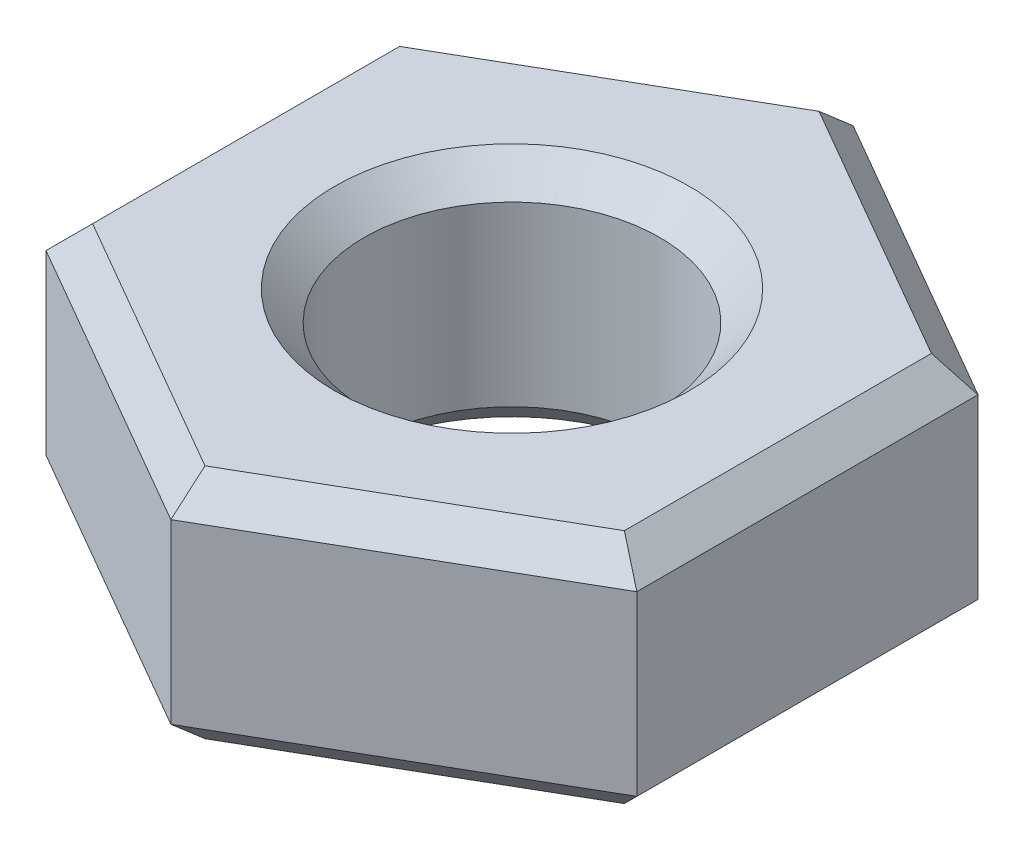
ISO-10303-21;
HEADER;
FILE_DESCRIPTION(('STEP AP214'),'2;1');
FILE_NAME('part.step','',(''),(''),'','','');
FILE_SCHEMA(('AUTOMOTIVE_DESIGN { 1 0 10303 214 1 1 1 1 }'));
ENDSEC;
DATA;
#1=APPLICATION_CONTEXT('core data for automotive mechanical design processes');
#2=APPLICATION_PROTOCOL_DEFINITION('international standard','automotive_design',2000,#1);
#3=PRODUCT_CONTEXT('',#1,'mechanical');
#4=PRODUCT('Part','Part','',(#3));
#5=PRODUCT_RELATED_PRODUCT_CATEGORY('part','',(#4));
#6=PRODUCT_DEFINITION_FORMATION('','',#4);
#7=PRODUCT_DEFINITION_CONTEXT('part definition',#1,'design');
#8=PRODUCT_DEFINITION('design','',#6,#7);
#9=PRODUCT_DEFINITION_SHAPE('','',#8);
#10=(LENGTH_UNIT() NAMED_UNIT(*) SI_UNIT(.MILLI.,.METRE.));
#11=(NAMED_UNIT(*) PLANE_ANGLE_UNIT() SI_UNIT($,.RADIAN.));
#12=(NAMED_UNIT(*) SI_UNIT($,.STERADIAN.) SOLID_ANGLE_UNIT());
#13=UNCERTAINTY_MEASURE_WITH_UNIT(LENGTH_MEASURE(1.E-05),#10,'distance_accuracy_value','');
#14=(GEOMETRIC_REPRESENTATION_CONTEXT(3) GLOBAL_UNCERTAINTY_ASSIGNED_CONTEXT((#13)) GLOBAL_UNIT_ASSIGNED_CONTEXT((#10,
#11,#12)) REPRESENTATION_CONTEXT('',''));
#15=CARTESIAN_POINT('',(0.,0.,0.));
#16=DIRECTION('',(0.,0.,1.));
#17=DIRECTION('',(1.,0.,0.));
#18=AXIS2_PLACEMENT_3D('',#15,#16,#17);
#19=CARTESIAN_POINT('',(0.,2.,0.));
#20=DIRECTION('',(0.,1.,0.));
#21=DIRECTION('',(0.,0.,1.));
#22=AXIS2_PLACEMENT_3D('',#19,#20,#21);
#23=PLANE('',#22);
#24=CARTESIAN_POINT('',(0.,2.,0.));
#25=DIRECTION('',(0.,1.,0.));
#26=DIRECTION('',(0.,0.,1.));
#27=AXIS2_PLACEMENT_3D('',#24,#25,#26);
#28=CIRCLE('',#27,1.5);
#29=CARTESIAN_POINT('',(0.,2.,1.5));
#30=VERTEX_POINT('',#29);
#31=EDGE_CURVE('E11',#30,#30,#28,.F.);
#32=ORIENTED_EDGE('',*,*,#31,.T.);
#33=EDGE_LOOP('',(#32));
#34=FACE_BOUND('',#33,.T.);
#35=DIRECTION('',(-0.866025403784435,0.,0.500000000000007));
#36=VECTOR('',#35,1.);
#37=CARTESIAN_POINT('',(-2.37500000000001,2.,-1.22686932202793));
#38=LINE('',#37,#36);
#39=CARTESIAN_POINT('',(0.,2.,-2.59807621135331));
#40=VERTEX_POINT('',#39);
#41=CARTESIAN_POINT('',(-2.25000000000001,2.,-1.29903810567664));
#42=VERTEX_POINT('',#41);
#43=EDGE_CURVE('E60',#40,#42,#38,.T.);
#44=ORIENTED_EDGE('',*,*,#43,.T.);
#45=DIRECTION('',(0.,0.,1.));
#46=VECTOR('',#45,1.);
#47=CARTESIAN_POINT('',(-2.24999999999998,2.,1.44337567297409));
#48=LINE('',#47,#46);
#49=CARTESIAN_POINT('',(-2.24999999999998,2.,1.29903810567668));
#50=VERTEX_POINT('',#49);
#51=EDGE_CURVE('E52',#42,#50,#48,.T.);
#52=ORIENTED_EDGE('',*,*,#51,.T.);
#53=DIRECTION('',(0.866025403784442,0.,0.499999999999995));
#54=VECTOR('',#53,1.);
#55=CARTESIAN_POINT('',(0.125,2.,2.67024499500202));
#56=LINE('',#55,#54);
#57=CARTESIAN_POINT('',(0.,2.,2.59807621135332));
#58=VERTEX_POINT('',#57);
#59=EDGE_CURVE('E218',#50,#58,#56,.T.);
#60=ORIENTED_EDGE('',*,*,#59,.T.);
#61=DIRECTION('',(0.866025403784438,0.,-0.500000000000001));
#62=VECTOR('',#61,1.);
#63=CARTESIAN_POINT('',(2.375,2.,1.22686932202795));
#64=LINE('',#63,#62);
#65=CARTESIAN_POINT('',(2.25,2.,1.29903810567665));
#66=VERTEX_POINT('',#65);
#67=EDGE_CURVE('E221',#58,#66,#64,.T.);
#68=ORIENTED_EDGE('',*,*,#67,.T.);
#69=DIRECTION('',(0.,0.,-1.));
#70=VECTOR('',#69,1.);
#71=CARTESIAN_POINT('',(2.24999999999999,2.,-1.44337567297408));
#72=LINE('',#71,#70);
#73=CARTESIAN_POINT('',(2.24999999999999,2.,-1.29903810567667));
#74=VERTEX_POINT('',#73);
#75=EDGE_CURVE('E224',#66,#74,#72,.T.);
#76=ORIENTED_EDGE('',*,*,#75,.T.);
#77=DIRECTION('',(-0.866025403784442,0.,-0.499999999999995));
#78=VECTOR('',#77,1.);
#79=CARTESIAN_POINT('',(-0.12500000000002,2.,-2.67024499500202));
#80=LINE('',#79,#78);
#81=EDGE_CURVE('E65',#74,#40,#80,.T.);
#82=ORIENTED_EDGE('',*,*,#81,.T.);
#83=EDGE_LOOP('',(#44,#52,#60,#68,#76,#82));
#84=FACE_BOUND('',#83,.T.);
#85=ADVANCED_FACE('F41',(#34,#84),#23,.T.);
#86=CARTESIAN_POINT('',(0.,0.,0.));
#87=DIRECTION('',(0.,1.,0.));
#88=DIRECTION('',(0.,0.,1.));
#89=AXIS2_PLACEMENT_3D('',#86,#87,#88);
#90=PLANE('',#89);
#91=CARTESIAN_POINT('',(0.,0.,0.));
#92=DIRECTION('',(0.,1.,0.));
#93=DIRECTION('',(0.,0.,1.));
#94=AXIS2_PLACEMENT_3D('',#91,#92,#93);
#95=CIRCLE('',#94,1.5);
#96=CARTESIAN_POINT('',(0.,0.,1.5));
#97=VERTEX_POINT('',#96);
#98=EDGE_CURVE('E164',#97,#97,#95,.T.);
#99=ORIENTED_EDGE('',*,*,#98,.T.);
#100=EDGE_LOOP('',(#99));
#101=FACE_BOUND('',#100,.T.);
#102=DIRECTION('',(0.,0.,1.));
#103=VECTOR('',#102,1.);
#104=CARTESIAN_POINT('',(2.25,0.,0.));
#105=LINE('',#104,#103);
#106=CARTESIAN_POINT('',(2.25,0.,-1.29903810567667));
#107=VERTEX_POINT('',#106);
#108=CARTESIAN_POINT('',(2.25,0.,1.29903810567665));
#109=VERTEX_POINT('',#108);
#110=EDGE_CURVE('E162',#107,#109,#105,.T.);
#111=ORIENTED_EDGE('',*,*,#110,.T.);
#112=DIRECTION('',(-0.866025403784438,0.,0.500000000000001));
#113=VECTOR('',#112,1.);
#114=CARTESIAN_POINT('',(1.125,0.,1.94855715851499));
#115=LINE('',#114,#113);
#116=CARTESIAN_POINT('',(0.,0.,2.59807621135332));
#117=VERTEX_POINT('',#116);
#118=EDGE_CURVE('E139',#109,#117,#115,.T.);
#119=ORIENTED_EDGE('',*,*,#118,.T.);
#120=DIRECTION('',(-0.866025403784442,0.,-0.499999999999995));
#121=VECTOR('',#120,1.);
#122=CARTESIAN_POINT('',(-1.12499999999999,0.,1.948557158515));
#123=LINE('',#122,#121);
#124=CARTESIAN_POINT('',(-2.24999999999999,0.,1.29903810567669));
#125=VERTEX_POINT('',#124);
#126=EDGE_CURVE('E150',#117,#125,#123,.T.);
#127=ORIENTED_EDGE('',*,*,#126,.T.);
#128=DIRECTION('',(0.,0.,-1.));
#129=VECTOR('',#128,1.);
#130=CARTESIAN_POINT('',(-2.25,0.,0.));
#131=LINE('',#130,#129);
#132=CARTESIAN_POINT('',(-2.25000000000001,0.,-1.29903810567664));
#133=VERTEX_POINT('',#132);
#134=EDGE_CURVE('E157',#125,#133,#131,.T.);
#135=ORIENTED_EDGE('',*,*,#134,.T.);
#136=DIRECTION('',(0.866025403784435,0.,-0.500000000000007));
#137=VECTOR('',#136,1.);
#138=CARTESIAN_POINT('',(-1.12500000000002,0.,-1.94855715851498));
#139=LINE('',#138,#137);
#140=CARTESIAN_POINT('',(0.,0.,-2.59807621135332));
#141=VERTEX_POINT('',#140);
#142=EDGE_CURVE('E301',#133,#141,#139,.T.);
#143=ORIENTED_EDGE('',*,*,#142,.T.);
#144=DIRECTION('',(0.866025403784442,0.,0.499999999999995));
#145=VECTOR('',#144,1.);
#146=CARTESIAN_POINT('',(1.12499999999999,0.,-1.94855715851499));
#147=LINE('',#146,#145);
#148=EDGE_CURVE('E171',#141,#107,#147,.T.);
#149=ORIENTED_EDGE('',*,*,#148,.T.);
#150=EDGE_LOOP('',(#111,#119,#127,#135,#143,#149));
#151=FACE_BOUND('',#150,.T.);
#152=ADVANCED_FACE('F160',(#101,#151),#90,.F.);
#153=CARTESIAN_POINT('',(-2.49999999999998,2.,1.44337567297409));
#154=DIRECTION('',(0.499999999999995,0.,-0.866025403784441));
#155=DIRECTION('',(-0.866025403784442,0.,-0.499999999999995));
#156=AXIS2_PLACEMENT_3D('',#153,#154,#155);
#157=PLANE('',#156);
#158=DIRECTION('',(0.,-1.,0.));
#159=VECTOR('',#158,1.);
#160=CARTESIAN_POINT('',(-2.49999999999998,2.,1.44337567297409));
#161=LINE('',#160,#159);
#162=CARTESIAN_POINT('',(-2.49999999999998,1.75,1.44337567297409));
#163=VERTEX_POINT('',#162);
#164=CARTESIAN_POINT('',(-2.49999999999998,0.249999999999999,1.44337567297409));
#165=VERTEX_POINT('',#164);
#166=EDGE_CURVE('E248',#163,#165,#161,.T.);
#167=ORIENTED_EDGE('',*,*,#166,.T.);
#168=DIRECTION('',(0.866025403784442,0.,0.499999999999995));
#169=VECTOR('',#168,1.);
#170=CARTESIAN_POINT('',(-2.49999999999998,0.249999999999999,1.44337567297409));
#171=LINE('',#170,#169);
#172=CARTESIAN_POINT('',(0.,0.249999999999999,2.88675134594813));
#173=VERTEX_POINT('',#172);
#174=EDGE_CURVE('E215',#165,#173,#171,.T.);
#175=ORIENTED_EDGE('',*,*,#174,.T.);
#176=DIRECTION('',(0.,-1.,0.));
#177=VECTOR('',#176,1.);
#178=CARTESIAN_POINT('',(0.,2.,2.88675134594813));
#179=LINE('',#178,#177);
#180=CARTESIAN_POINT('',(0.,1.75,2.88675134594813));
#181=VERTEX_POINT('',#180);
#182=EDGE_CURVE('E158',#181,#173,#179,.T.);
#183=ORIENTED_EDGE('',*,*,#182,.F.);
#184=DIRECTION('',(-0.866025403784442,0.,-0.499999999999995));
#185=VECTOR('',#184,1.);
#186=CARTESIAN_POINT('',(-2.49999999999998,1.75,1.44337567297409));
#187=LINE('',#186,#185);
#188=EDGE_CURVE('E212',#181,#163,#187,.T.);
#189=ORIENTED_EDGE('',*,*,#188,.T.);
#190=EDGE_LOOP('',(#167,#175,#183,#189));
#191=FACE_BOUND('',#190,.T.);
#192=ADVANCED_FACE('F330',(#191),#157,.F.);
#193=CARTESIAN_POINT('',(0.,2.,2.88675134594813));
#194=DIRECTION('',(-0.500000000000001,0.,-0.866025403784438));
#195=DIRECTION('',(-0.866025403784438,0.,0.500000000000001));
#196=AXIS2_PLACEMENT_3D('',#193,#194,#195);
#197=PLANE('',#196);
#198=ORIENTED_EDGE('',*,*,#182,.T.);
#199=DIRECTION('',(0.866025403784438,0.,-0.500000000000001));
#200=VECTOR('',#199,1.);
#201=CARTESIAN_POINT('',(0.,0.249999999999999,2.88675134594813));
#202=LINE('',#201,#200);
#203=CARTESIAN_POINT('',(2.50000000000001,0.249999999999999,1.44337567297406));
#204=VERTEX_POINT('',#203);
#205=EDGE_CURVE('E142',#173,#204,#202,.T.);
#206=ORIENTED_EDGE('',*,*,#205,.T.);
#207=DIRECTION('',(0.,-1.,0.));
#208=VECTOR('',#207,1.);
#209=CARTESIAN_POINT('',(2.50000000000001,2.,1.44337567297406));
#210=LINE('',#209,#208);
#211=CARTESIAN_POINT('',(2.50000000000001,1.75,1.44337567297406));
#212=VERTEX_POINT('',#211);
#213=EDGE_CURVE('E283',#212,#204,#210,.T.);
#214=ORIENTED_EDGE('',*,*,#213,.F.);
#215=DIRECTION('',(-0.866025403784438,0.,0.500000000000001));
#216=VECTOR('',#215,1.);
#217=CARTESIAN_POINT('',(0.,1.75,2.88675134594813));
#218=LINE('',#217,#216);
#219=EDGE_CURVE('E182',#212,#181,#218,.T.);
#220=ORIENTED_EDGE('',*,*,#219,.T.);
#221=EDGE_LOOP('',(#198,#206,#214,#220));
#222=FACE_BOUND('',#221,.T.);
#223=ADVANCED_FACE('F288',(#222),#197,.F.);
#224=CARTESIAN_POINT('',(2.50000000000001,2.,1.44337567297406));
#225=DIRECTION('',(-1.,0.,0.));
#226=DIRECTION('',(0.,0.,1.));
#227=AXIS2_PLACEMENT_3D('',#224,#225,#226);
#228=PLANE('',#227);
#229=ORIENTED_EDGE('',*,*,#213,.T.);
#230=DIRECTION('',(0.,0.,-1.));
#231=VECTOR('',#230,1.);
#232=CARTESIAN_POINT('',(2.50000000000001,0.249999999999999,1.44337567297406));
#233=LINE('',#232,#231);
#234=CARTESIAN_POINT('',(2.5,0.249999999999999,-1.44337567297408));
#235=VERTEX_POINT('',#234);
#236=EDGE_CURVE('E190',#204,#235,#233,.T.);
#237=ORIENTED_EDGE('',*,*,#236,.T.);
#238=DIRECTION('',(0.,-1.,0.));
#239=VECTOR('',#238,1.);
#240=CARTESIAN_POINT('',(2.5,2.,-1.44337567297408));
#241=LINE('',#240,#239);
#242=CARTESIAN_POINT('',(2.5,1.75,-1.44337567297408));
#243=VERTEX_POINT('',#242);
#244=EDGE_CURVE('E285',#243,#235,#241,.T.);
#245=ORIENTED_EDGE('',*,*,#244,.F.);
#246=DIRECTION('',(0.,0.,1.));
#247=VECTOR('',#246,1.);
#248=CARTESIAN_POINT('',(2.50000000000001,1.75,1.44337567297406));
#249=LINE('',#248,#247);
#250=EDGE_CURVE('E187',#243,#212,#249,.T.);
#251=ORIENTED_EDGE('',*,*,#250,.T.);
#252=EDGE_LOOP('',(#229,#237,#245,#251));
#253=FACE_BOUND('',#252,.T.);
#254=ADVANCED_FACE('F282',(#253),#228,.F.);
#255=CARTESIAN_POINT('',(2.5,2.,-1.44337567297408));
#256=DIRECTION('',(-0.499999999999995,0.,0.866025403784442));
#257=DIRECTION('',(0.866025403784442,0.,0.499999999999995));
#258=AXIS2_PLACEMENT_3D('',#255,#256,#257);
#259=PLANE('',#258);
#260=ORIENTED_EDGE('',*,*,#244,.T.);
#261=DIRECTION('',(-0.866025403784442,0.,-0.499999999999995));
#262=VECTOR('',#261,1.);
#263=CARTESIAN_POINT('',(2.5,0.249999999999999,-1.44337567297408));
#264=LINE('',#263,#262);
#265=CARTESIAN_POINT('',(0.,0.249999999999999,-2.88675134594813));
#266=VERTEX_POINT('',#265);
#267=EDGE_CURVE('E196',#235,#266,#264,.T.);
#268=ORIENTED_EDGE('',*,*,#267,.T.);
#269=DIRECTION('',(0.,-1.,0.));
#270=VECTOR('',#269,1.);
#271=CARTESIAN_POINT('',(0.,2.,-2.88675134594813));
#272=LINE('',#271,#270);
#273=CARTESIAN_POINT('',(0.,1.75,-2.88675134594813));
#274=VERTEX_POINT('',#273);
#275=EDGE_CURVE('E295',#274,#266,#272,.T.);
#276=ORIENTED_EDGE('',*,*,#275,.F.);
#277=DIRECTION('',(0.866025403784442,0.,0.499999999999995));
#278=VECTOR('',#277,1.);
#279=CARTESIAN_POINT('',(2.5,1.75,-1.44337567297408));
#280=LINE('',#279,#278);
#281=EDGE_CURVE('E193',#274,#243,#280,.T.);
#282=ORIENTED_EDGE('',*,*,#281,.T.);
#283=EDGE_LOOP('',(#260,#268,#276,#282));
#284=FACE_BOUND('',#283,.T.);
#285=ADVANCED_FACE('F315',(#284),#259,.F.);
#286=CARTESIAN_POINT('',(0.,2.,-2.88675134594813));
#287=DIRECTION('',(0.500000000000007,0.,0.866025403784435));
#288=DIRECTION('',(0.866025403784435,0.,-0.500000000000007));
#289=AXIS2_PLACEMENT_3D('',#286,#287,#288);
#290=PLANE('',#289);
#291=ORIENTED_EDGE('',*,*,#275,.T.);
#292=DIRECTION('',(-0.866025403784435,0.,0.500000000000007));
#293=VECTOR('',#292,1.);
#294=CARTESIAN_POINT('',(0.,0.249999999999999,-2.88675134594813));
#295=LINE('',#294,#293);
#296=CARTESIAN_POINT('',(-2.50000000000002,0.249999999999999,-1.44337567297404));
#297=VERTEX_POINT('',#296);
#298=EDGE_CURVE('E202',#266,#297,#295,.T.);
#299=ORIENTED_EDGE('',*,*,#298,.T.);
#300=DIRECTION('',(0.,-1.,0.));
#301=VECTOR('',#300,1.);
#302=CARTESIAN_POINT('',(-2.50000000000002,2.,-1.44337567297404));
#303=LINE('',#302,#301);
#304=CARTESIAN_POINT('',(-2.50000000000002,1.75,-1.44337567297404));
#305=VERTEX_POINT('',#304);
#306=EDGE_CURVE('E321',#305,#297,#303,.T.);
#307=ORIENTED_EDGE('',*,*,#306,.F.);
#308=DIRECTION('',(0.866025403784435,0.,-0.500000000000007));
#309=VECTOR('',#308,1.);
#310=CARTESIAN_POINT('',(0.,1.75,-2.88675134594813));
#311=LINE('',#310,#309);
#312=EDGE_CURVE('E199',#305,#274,#311,.T.);
#313=ORIENTED_EDGE('',*,*,#312,.T.);
#314=EDGE_LOOP('',(#291,#299,#307,#313));
#315=FACE_BOUND('',#314,.T.);
#316=ADVANCED_FACE('F341',(#315),#290,.F.);
#317=CARTESIAN_POINT('',(-2.50000000000002,2.,-1.44337567297404));
#318=DIRECTION('',(1.,0.,0.));
#319=DIRECTION('',(0.,0.,-1.));
#320=AXIS2_PLACEMENT_3D('',#317,#318,#319);
#321=PLANE('',#320);
#322=ORIENTED_EDGE('',*,*,#306,.T.);
#323=DIRECTION('',(0.,0.,1.));
#324=VECTOR('',#323,1.);
#325=CARTESIAN_POINT('',(-2.50000000000002,0.249999999999999,-1.44337567297404));
#326=LINE('',#325,#324);
#327=EDGE_CURVE('E209',#297,#165,#326,.T.);
#328=ORIENTED_EDGE('',*,*,#327,.T.);
#329=ORIENTED_EDGE('',*,*,#166,.F.);
#330=DIRECTION('',(0.,0.,-1.));
#331=VECTOR('',#330,1.);
#332=CARTESIAN_POINT('',(-2.50000000000002,1.75,-1.44337567297404));
#333=LINE('',#332,#331);
#334=EDGE_CURVE('E205',#163,#305,#333,.T.);
#335=ORIENTED_EDGE('',*,*,#334,.T.);
#336=EDGE_LOOP('',(#322,#328,#329,#335));
#337=FACE_BOUND('',#336,.T.);
#338=ADVANCED_FACE('F342',(#337),#321,.F.);
#339=CARTESIAN_POINT('',(0.,2.,0.));
#340=DIRECTION('',(0.,-1.,0.));
#341=DIRECTION('',(0.,0.,-1.));
#342=AXIS2_PLACEMENT_3D('',#339,#340,#341);
#343=CYLINDRICAL_SURFACE('',#342,1.25);
#344=CARTESIAN_POINT('',(0.,0.25,0.));
#345=DIRECTION('',(0.,1.,0.));
#346=DIRECTION('',(0.,0.,1.));
#347=AXIS2_PLACEMENT_3D('',#344,#345,#346);
#348=CIRCLE('',#347,1.25);
#349=CARTESIAN_POINT('',(0.,0.25,1.25));
#350=VERTEX_POINT('',#349);
#351=EDGE_CURVE('E178',#350,#350,#348,.F.);
#352=ORIENTED_EDGE('',*,*,#351,.T.);
#353=EDGE_LOOP('',(#352));
#354=FACE_BOUND('',#353,.T.);
#355=CARTESIAN_POINT('',(0.,1.75,0.));
#356=DIRECTION('',(0.,1.,0.));
#357=DIRECTION('',(0.,0.,1.));
#358=AXIS2_PLACEMENT_3D('',#355,#356,#357);
#359=CIRCLE('',#358,1.25);
#360=CARTESIAN_POINT('',(0.,1.75,1.25));
#361=VERTEX_POINT('',#360);
#362=EDGE_CURVE('E169',#361,#361,#359,.T.);
#363=ORIENTED_EDGE('',*,*,#362,.T.);
#364=EDGE_LOOP('',(#363));
#365=FACE_BOUND('',#364,.T.);
#366=ADVANCED_FACE('F361',(#354,#365),#343,.F.);
#367=CARTESIAN_POINT('',(0.,0.,0.));
#368=DIRECTION('',(0.,-1.,0.));
#369=DIRECTION('',(0.,0.,-1.));
#370=AXIS2_PLACEMENT_3D('',#367,#368,#369);
#371=CONICAL_SURFACE('',#370,1.5,0.785398163397448);
#372=ORIENTED_EDGE('',*,*,#351,.F.);
#373=EDGE_LOOP('',(#372));
#374=FACE_BOUND('',#373,.T.);
#375=ORIENTED_EDGE('',*,*,#98,.F.);
#376=EDGE_LOOP('',(#375));
#377=FACE_BOUND('',#376,.T.);
#378=ADVANCED_FACE('F376',(#374,#377),#371,.F.);
#379=CARTESIAN_POINT('',(0.,0.249999999999999,-2.88675134594813));
#380=DIRECTION('',(0.353553390593277,0.70710678118655,0.61237243569579));
#381=DIRECTION('',(-0.866025403784435,0.,0.500000000000007));
#382=AXIS2_PLACEMENT_3D('',#379,#380,#381);
#383=PLANE('',#382);
#384=DIRECTION('',(0.,-0.654653670707975,0.755928946018456));
#385=VECTOR('',#384,1.);
#386=CARTESIAN_POINT('',(0.,0.249999999999999,-2.88675134594813));
#387=LINE('',#386,#385);
#388=EDGE_CURVE('E240',#141,#266,#387,.F.);
#389=ORIENTED_EDGE('',*,*,#388,.F.);
#390=ORIENTED_EDGE('',*,*,#142,.F.);
#391=DIRECTION('',(0.654653670707982,-0.654653670707975,0.377964473009223));
#392=VECTOR('',#391,1.);
#393=CARTESIAN_POINT('',(-2.50000000000002,0.249999999999999,-1.44337567297404));
#394=LINE('',#393,#392);
#395=EDGE_CURVE('E244',#297,#133,#394,.T.);
#396=ORIENTED_EDGE('',*,*,#395,.F.);
#397=ORIENTED_EDGE('',*,*,#298,.F.);
#398=EDGE_LOOP('',(#389,#390,#396,#397));
#399=FACE_BOUND('',#398,.T.);
#400=ADVANCED_FACE('F339',(#399),#383,.F.);
#401=CARTESIAN_POINT('',(-2.50000000000002,0.249999999999999,-1.44337567297404));
#402=DIRECTION('',(0.707106781186546,0.707106781186549,0.));
#403=DIRECTION('',(0.,0.,1.));
#404=AXIS2_PLACEMENT_3D('',#401,#402,#403);
#405=PLANE('',#404);
#406=ORIENTED_EDGE('',*,*,#395,.T.);
#407=ORIENTED_EDGE('',*,*,#134,.F.);
#408=DIRECTION('',(0.654653670707975,-0.654653670707975,-0.377964473009234));
#409=VECTOR('',#408,1.);
#410=CARTESIAN_POINT('',(-2.49999999999998,0.249999999999999,1.44337567297409));
#411=LINE('',#410,#409);
#412=EDGE_CURVE('E153',#165,#125,#411,.T.);
#413=ORIENTED_EDGE('',*,*,#412,.F.);
#414=ORIENTED_EDGE('',*,*,#327,.F.);
#415=EDGE_LOOP('',(#406,#407,#413,#414));
#416=FACE_BOUND('',#415,.T.);
#417=ADVANCED_FACE('F336',(#416),#405,.F.);
#418=CARTESIAN_POINT('',(2.5,0.249999999999999,-1.44337567297408));
#419=DIRECTION('',(-0.35355339059327,0.707106781186549,0.612372435695796));
#420=DIRECTION('',(-0.866025403784442,0.,-0.499999999999995));
#421=AXIS2_PLACEMENT_3D('',#418,#419,#420);
#422=PLANE('',#421);
#423=ORIENTED_EDGE('',*,*,#388,.T.);
#424=ORIENTED_EDGE('',*,*,#267,.F.);
#425=DIRECTION('',(-0.654653670707977,-0.654653670707975,0.37796447300923));
#426=VECTOR('',#425,1.);
#427=CARTESIAN_POINT('',(2.5,0.249999999999999,-1.44337567297408));
#428=LINE('',#427,#426);
#429=EDGE_CURVE('E146',#107,#235,#428,.F.);
#430=ORIENTED_EDGE('',*,*,#429,.F.);
#431=ORIENTED_EDGE('',*,*,#148,.F.);
#432=EDGE_LOOP('',(#423,#424,#430,#431));
#433=FACE_BOUND('',#432,.T.);
#434=ADVANCED_FACE('F310',(#433),#422,.F.);
#435=CARTESIAN_POINT('',(-2.49999999999998,0.249999999999999,1.44337567297409));
#436=DIRECTION('',(0.353553390593269,0.70710678118655,-0.612372435695795));
#437=DIRECTION('',(0.866025403784442,0.,0.499999999999995));
#438=AXIS2_PLACEMENT_3D('',#435,#436,#437);
#439=PLANE('',#438);
#440=ORIENTED_EDGE('',*,*,#412,.T.);
#441=ORIENTED_EDGE('',*,*,#126,.F.);
#442=DIRECTION('',(0.,0.654653670707976,0.755928946018456));
#443=VECTOR('',#442,1.);
#444=CARTESIAN_POINT('',(0.,-0.464285714285701,2.06196524710582));
#445=LINE('',#444,#443);
#446=EDGE_CURVE('E135',#173,#117,#445,.F.);
#447=ORIENTED_EDGE('',*,*,#446,.F.);
#448=ORIENTED_EDGE('',*,*,#174,.F.);
#449=EDGE_LOOP('',(#440,#441,#447,#448));
#450=FACE_BOUND('',#449,.T.);
#451=ADVANCED_FACE('F151',(#450),#439,.F.);
#452=CARTESIAN_POINT('',(2.50000000000001,0.249999999999999,1.44337567297406));
#453=DIRECTION('',(-0.707106781186546,0.707106781186549,0.));
#454=DIRECTION('',(0.,0.,-1.));
#455=AXIS2_PLACEMENT_3D('',#452,#453,#454);
#456=PLANE('',#455);
#457=ORIENTED_EDGE('',*,*,#429,.T.);
#458=ORIENTED_EDGE('',*,*,#236,.F.);
#459=DIRECTION('',(-0.65465367070798,-0.654653670707976,-0.377964473009225));
#460=VECTOR('',#459,1.);
#461=CARTESIAN_POINT('',(2.50000000000001,0.249999999999999,1.44337567297406));
#462=LINE('',#461,#460);
#463=EDGE_CURVE('E147',#109,#204,#462,.F.);
#464=ORIENTED_EDGE('',*,*,#463,.F.);
#465=ORIENTED_EDGE('',*,*,#110,.F.);
#466=EDGE_LOOP('',(#457,#458,#464,#465));
#467=FACE_BOUND('',#466,.T.);
#468=ADVANCED_FACE('F313',(#467),#456,.F.);
#469=CARTESIAN_POINT('',(0.,0.249999999999999,2.88675134594813));
#470=DIRECTION('',(-0.353553390593274,0.707106781186548,-0.612372435695793));
#471=DIRECTION('',(0.866025403784438,0.,-0.500000000000001));
#472=AXIS2_PLACEMENT_3D('',#469,#470,#471);
#473=PLANE('',#472);
#474=ORIENTED_EDGE('',*,*,#446,.T.);
#475=ORIENTED_EDGE('',*,*,#118,.F.);
#476=ORIENTED_EDGE('',*,*,#463,.T.);
#477=ORIENTED_EDGE('',*,*,#205,.F.);
#478=EDGE_LOOP('',(#474,#475,#476,#477));
#479=FACE_BOUND('',#478,.T.);
#480=ADVANCED_FACE('F137',(#479),#473,.F.);
#481=CARTESIAN_POINT('',(0.,1.75,0.));
#482=DIRECTION('',(0.,1.,0.));
#483=DIRECTION('',(0.,0.,1.));
#484=AXIS2_PLACEMENT_3D('',#481,#482,#483);
#485=CONICAL_SURFACE('',#484,1.25,0.785398163397452);
#486=ORIENTED_EDGE('',*,*,#31,.F.);
#487=EDGE_LOOP('',(#486));
#488=FACE_BOUND('',#487,.T.);
#489=ORIENTED_EDGE('',*,*,#362,.F.);
#490=EDGE_LOOP('',(#489));
#491=FACE_BOUND('',#490,.T.);
#492=ADVANCED_FACE('F390',(#488,#491),#485,.F.);
#493=CARTESIAN_POINT('',(2.25,2.,0.));
#494=DIRECTION('',(0.70710678118655,0.707106781186545,0.));
#495=DIRECTION('',(0.,0.,1.));
#496=AXIS2_PLACEMENT_3D('',#493,#494,#495);
#497=PLANE('',#496);
#498=DIRECTION('',(-0.654653670707976,0.654653670707979,-0.377964473009225));
#499=VECTOR('',#498,1.);
#500=CARTESIAN_POINT('',(1.92857142857143,2.32142857142857,1.11346123343713));
#501=LINE('',#500,#499);
#502=EDGE_CURVE('E262',#212,#66,#501,.T.);
#503=ORIENTED_EDGE('',*,*,#502,.F.);
#504=ORIENTED_EDGE('',*,*,#250,.F.);
#505=DIRECTION('',(-0.654653670707974,0.654653670707979,0.37796447300923));
#506=VECTOR('',#505,1.);
#507=CARTESIAN_POINT('',(1.92857142857142,2.32142857142857,-1.11346123343714));
#508=LINE('',#507,#506);
#509=EDGE_CURVE('E46',#74,#243,#508,.F.);
#510=ORIENTED_EDGE('',*,*,#509,.F.);
#511=ORIENTED_EDGE('',*,*,#75,.F.);
#512=EDGE_LOOP('',(#503,#504,#510,#511));
#513=FACE_BOUND('',#512,.T.);
#514=ADVANCED_FACE('F44',(#513),#497,.T.);
#515=CARTESIAN_POINT('',(1.12499999999999,2.,-1.94855715851499));
#516=DIRECTION('',(0.353553390593271,0.707106781186546,-0.612372435695798));
#517=DIRECTION('',(0.866025403784442,0.,0.499999999999995));
#518=AXIS2_PLACEMENT_3D('',#515,#516,#517);
#519=PLANE('',#518);
#520=ORIENTED_EDGE('',*,*,#509,.T.);
#521=ORIENTED_EDGE('',*,*,#281,.F.);
#522=DIRECTION('',(0.,0.654653670707979,0.755928946018453));
#523=VECTOR('',#522,1.);
#524=CARTESIAN_POINT('',(0.,2.32142857142857,-2.22692246687427));
#525=LINE('',#524,#523);
#526=EDGE_CURVE('E259',#40,#274,#525,.F.);
#527=ORIENTED_EDGE('',*,*,#526,.F.);
#528=ORIENTED_EDGE('',*,*,#81,.F.);
#529=EDGE_LOOP('',(#520,#521,#527,#528));
#530=FACE_BOUND('',#529,.T.);
#531=ADVANCED_FACE('F274',(#530),#519,.T.);
#532=CARTESIAN_POINT('',(1.125,2.,1.94855715851498));
#533=DIRECTION('',(0.353553390593275,0.707106781186545,0.612372435695796));
#534=DIRECTION('',(-0.866025403784438,0.,0.500000000000001));
#535=AXIS2_PLACEMENT_3D('',#532,#533,#534);
#536=PLANE('',#535);
#537=ORIENTED_EDGE('',*,*,#502,.T.);
#538=ORIENTED_EDGE('',*,*,#67,.F.);
#539=DIRECTION('',(0.,0.654653670707979,-0.755928946018453));
#540=VECTOR('',#539,1.);
#541=CARTESIAN_POINT('',(0.,2.32142857142857,2.22692246687428));
#542=LINE('',#541,#540);
#543=EDGE_CURVE('E255',#181,#58,#542,.T.);
#544=ORIENTED_EDGE('',*,*,#543,.F.);
#545=ORIENTED_EDGE('',*,*,#219,.F.);
#546=EDGE_LOOP('',(#537,#538,#544,#545));
#547=FACE_BOUND('',#546,.T.);
#548=ADVANCED_FACE('F436',(#547),#536,.T.);
#549=CARTESIAN_POINT('',(-1.12500000000001,2.,-1.94855715851498));
#550=DIRECTION('',(-0.353553390593279,0.707106781186546,-0.612372435695793));
#551=DIRECTION('',(0.866025403784435,0.,-0.500000000000007));
#552=AXIS2_PLACEMENT_3D('',#549,#550,#551);
#553=PLANE('',#552);
#554=ORIENTED_EDGE('',*,*,#526,.T.);
#555=ORIENTED_EDGE('',*,*,#312,.F.);
#556=DIRECTION('',(0.654653670707979,0.654653670707978,0.377964473009222));
#557=VECTOR('',#556,1.);
#558=CARTESIAN_POINT('',(-1.92857142857144,2.32142857142857,-1.11346123343712));
#559=LINE('',#558,#557);
#560=EDGE_CURVE('E252',#42,#305,#559,.F.);
#561=ORIENTED_EDGE('',*,*,#560,.F.);
#562=ORIENTED_EDGE('',*,*,#43,.F.);
#563=EDGE_LOOP('',(#554,#555,#561,#562));
#564=FACE_BOUND('',#563,.T.);
#565=ADVANCED_FACE('F430',(#564),#553,.T.);
#566=CARTESIAN_POINT('',(-1.12499999999999,2.,1.948557158515));
#567=DIRECTION('',(-0.353553390593271,0.707106781186546,0.612372435695797));
#568=DIRECTION('',(-0.866025403784442,0.,-0.499999999999995));
#569=AXIS2_PLACEMENT_3D('',#566,#567,#568);
#570=PLANE('',#569);
#571=ORIENTED_EDGE('',*,*,#543,.T.);
#572=ORIENTED_EDGE('',*,*,#59,.F.);
#573=DIRECTION('',(-0.654653670707972,-0.654653670707979,0.377964473009233));
#574=VECTOR('',#573,1.);
#575=CARTESIAN_POINT('',(-1.92857142857142,2.32142857142857,1.11346123343716));
#576=LINE('',#575,#574);
#577=EDGE_CURVE('E249',#163,#50,#576,.F.);
#578=ORIENTED_EDGE('',*,*,#577,.F.);
#579=ORIENTED_EDGE('',*,*,#188,.F.);
#580=EDGE_LOOP('',(#571,#572,#578,#579));
#581=FACE_BOUND('',#580,.T.);
#582=ADVANCED_FACE('F350',(#581),#570,.T.);
#583=CARTESIAN_POINT('',(-2.25,2.,0.));
#584=DIRECTION('',(-0.707106781186549,0.707106781186546,0.));
#585=DIRECTION('',(0.,0.,-1.));
#586=AXIS2_PLACEMENT_3D('',#583,#584,#585);
#587=PLANE('',#586);
#588=ORIENTED_EDGE('',*,*,#560,.T.);
#589=ORIENTED_EDGE('',*,*,#334,.F.);
#590=ORIENTED_EDGE('',*,*,#577,.T.);
#591=ORIENTED_EDGE('',*,*,#51,.F.);
#592=EDGE_LOOP('',(#588,#589,#590,#591));
#593=FACE_BOUND('',#592,.T.);
#594=ADVANCED_FACE('F345',(#593),#587,.T.);
#595=CLOSED_SHELL('',(#85,#152,#192,#223,#254,#285,#316,#338,#366,#378,#400,#417,#434,#451,#468,
#480,#492,#514,#531,#548,#565,#582,#594));
#596=MANIFOLD_SOLID_BREP('B2',#595);
#597=ADVANCED_BREP_SHAPE_REPRESENTATION('',(#18,#596),#14);
#598=SHAPE_DEFINITION_REPRESENTATION(#9,#597);
ENDSEC;
END-ISO-10303-21;
